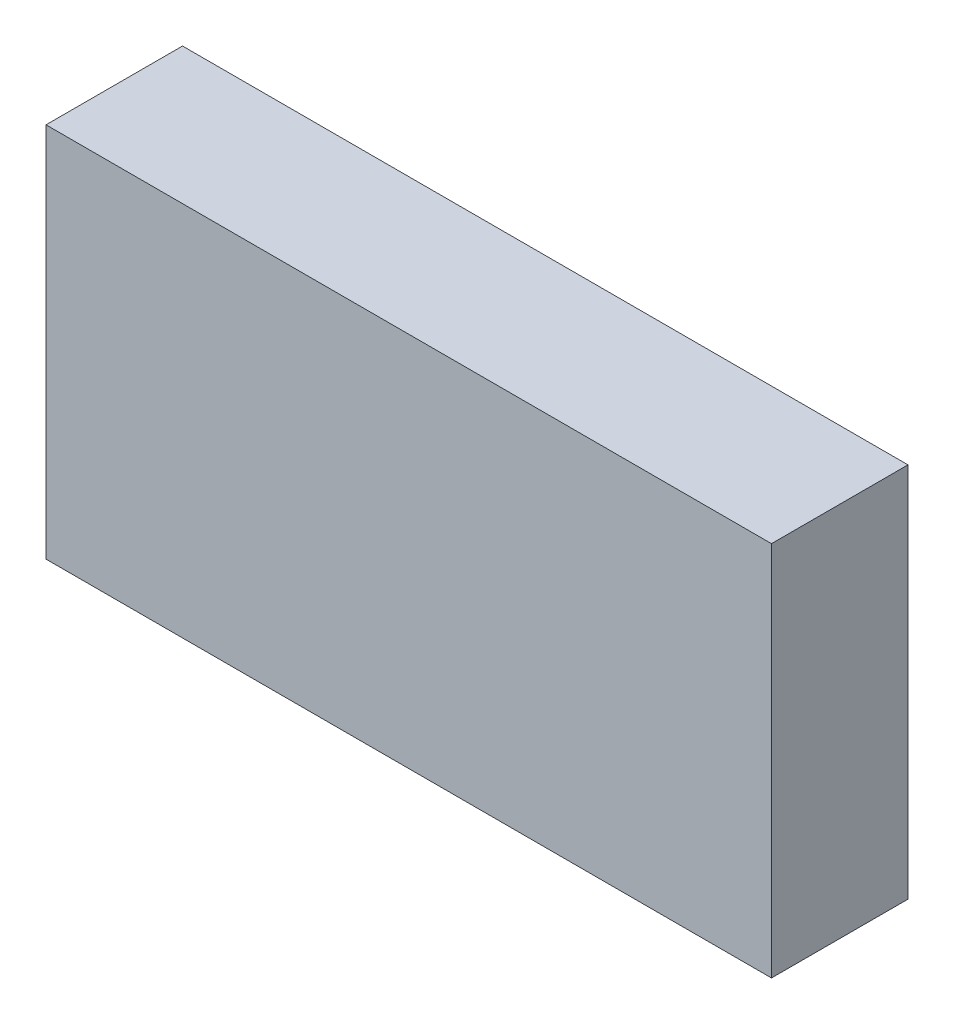
ISO-10303-21;
HEADER;
FILE_DESCRIPTION(('STEP AP214'),'2;1');
FILE_NAME('part.step','',(''),(''),'','','');
FILE_SCHEMA(('AUTOMOTIVE_DESIGN { 1 0 10303 214 1 1 1 1 }'));
ENDSEC;
DATA;
#1=APPLICATION_CONTEXT('core data for automotive mechanical design processes');
#2=APPLICATION_PROTOCOL_DEFINITION('international standard','automotive_design',2000,#1);
#3=PRODUCT_CONTEXT('',#1,'mechanical');
#4=PRODUCT('Part','Part','',(#3));
#5=PRODUCT_RELATED_PRODUCT_CATEGORY('part','',(#4));
#6=PRODUCT_DEFINITION_FORMATION('','',#4);
#7=PRODUCT_DEFINITION_CONTEXT('part definition',#1,'design');
#8=PRODUCT_DEFINITION('design','',#6,#7);
#9=PRODUCT_DEFINITION_SHAPE('','',#8);
#10=(LENGTH_UNIT() NAMED_UNIT(*) SI_UNIT(.MILLI.,.METRE.));
#11=(NAMED_UNIT(*) PLANE_ANGLE_UNIT() SI_UNIT($,.RADIAN.));
#12=(NAMED_UNIT(*) SI_UNIT($,.STERADIAN.) SOLID_ANGLE_UNIT());
#13=UNCERTAINTY_MEASURE_WITH_UNIT(LENGTH_MEASURE(1.E-05),#10,'distance_accuracy_value','');
#14=(GEOMETRIC_REPRESENTATION_CONTEXT(3) GLOBAL_UNCERTAINTY_ASSIGNED_CONTEXT((#13)) GLOBAL_UNIT_ASSIGNED_CONTEXT((#10,
#11,#12)) REPRESENTATION_CONTEXT('',''));
#15=CARTESIAN_POINT('',(0.,0.,0.));
#16=DIRECTION('',(0.,0.,1.));
#17=DIRECTION('',(1.,0.,0.));
#18=AXIS2_PLACEMENT_3D('',#15,#16,#17);
#19=CARTESIAN_POINT('',(-0.67499992,0.3499993,0.));
#20=DIRECTION('',(1.,0.,0.));
#21=DIRECTION('',(0.,-1.,0.));
#22=AXIS2_PLACEMENT_3D('',#19,#20,#21);
#23=PLANE('',#22);
#24=DIRECTION('',(0.,-1.,0.));
#25=VECTOR('',#24,1.);
#26=CARTESIAN_POINT('',(-0.67499992,0.3499993,0.));
#27=LINE('',#26,#25);
#28=CARTESIAN_POINT('',(-0.67499992,0.3499993,0.));
#29=VERTEX_POINT('',#28);
#30=CARTESIAN_POINT('',(-0.67499992,-0.3499993,0.));
#31=VERTEX_POINT('',#30);
#32=EDGE_CURVE('E11',#29,#31,#27,.T.);
#33=ORIENTED_EDGE('',*,*,#32,.T.);
#34=DIRECTION('',(0.,0.,1.));
#35=VECTOR('',#34,1.);
#36=CARTESIAN_POINT('',(-0.67499992,-0.3499993,0.));
#37=LINE('',#36,#35);
#38=CARTESIAN_POINT('',(-0.67499992,-0.3499993,0.254));
#39=VERTEX_POINT('',#38);
#40=EDGE_CURVE('E24',#31,#39,#37,.T.);
#41=ORIENTED_EDGE('',*,*,#40,.T.);
#42=DIRECTION('',(0.,-1.,0.));
#43=VECTOR('',#42,1.);
#44=CARTESIAN_POINT('',(-0.67499992,0.3499993,0.254));
#45=LINE('',#44,#43);
#46=CARTESIAN_POINT('',(-0.67499992,0.3499993,0.254));
#47=VERTEX_POINT('',#46);
#48=EDGE_CURVE('E87',#47,#39,#45,.T.);
#49=ORIENTED_EDGE('',*,*,#48,.F.);
#50=DIRECTION('',(0.,0.,1.));
#51=VECTOR('',#50,1.);
#52=CARTESIAN_POINT('',(-0.67499992,0.3499993,0.));
#53=LINE('',#52,#51);
#54=EDGE_CURVE('E36',#29,#47,#53,.T.);
#55=ORIENTED_EDGE('',*,*,#54,.F.);
#56=EDGE_LOOP('',(#33,#41,#49,#55));
#57=FACE_BOUND('',#56,.T.);
#58=ADVANCED_FACE('F17',(#57),#23,.F.);
#59=CARTESIAN_POINT('',(-0.67499992,-0.3499993,0.));
#60=DIRECTION('',(0.,1.,0.));
#61=DIRECTION('',(1.,0.,0.));
#62=AXIS2_PLACEMENT_3D('',#59,#60,#61);
#63=PLANE('',#62);
#64=DIRECTION('',(1.,0.,0.));
#65=VECTOR('',#64,1.);
#66=CARTESIAN_POINT('',(-0.67499992,-0.3499993,0.));
#67=LINE('',#66,#65);
#68=CARTESIAN_POINT('',(0.67499992,-0.3499993,0.));
#69=VERTEX_POINT('',#68);
#70=EDGE_CURVE('E84',#31,#69,#67,.T.);
#71=ORIENTED_EDGE('',*,*,#70,.T.);
#72=DIRECTION('',(0.,0.,1.));
#73=VECTOR('',#72,1.);
#74=CARTESIAN_POINT('',(0.67499992,-0.3499993,0.));
#75=LINE('',#74,#73);
#76=CARTESIAN_POINT('',(0.67499992,-0.3499993,0.254));
#77=VERTEX_POINT('',#76);
#78=EDGE_CURVE('E82',#69,#77,#75,.T.);
#79=ORIENTED_EDGE('',*,*,#78,.T.);
#80=DIRECTION('',(1.,0.,0.));
#81=VECTOR('',#80,1.);
#82=CARTESIAN_POINT('',(-0.67499992,-0.3499993,0.254));
#83=LINE('',#82,#81);
#84=EDGE_CURVE('E62',#39,#77,#83,.T.);
#85=ORIENTED_EDGE('',*,*,#84,.F.);
#86=ORIENTED_EDGE('',*,*,#40,.F.);
#87=EDGE_LOOP('',(#71,#79,#85,#86));
#88=FACE_BOUND('',#87,.T.);
#89=ADVANCED_FACE('F89',(#88),#63,.F.);
#90=CARTESIAN_POINT('',(0.67499992,-0.3499993,0.));
#91=DIRECTION('',(-1.,0.,0.));
#92=DIRECTION('',(0.,1.,0.));
#93=AXIS2_PLACEMENT_3D('',#90,#91,#92);
#94=PLANE('',#93);
#95=DIRECTION('',(0.,1.,0.));
#96=VECTOR('',#95,1.);
#97=CARTESIAN_POINT('',(0.67499992,-0.3499993,0.));
#98=LINE('',#97,#96);
#99=CARTESIAN_POINT('',(0.67499992,0.3499993,0.));
#100=VERTEX_POINT('',#99);
#101=EDGE_CURVE('E71',#69,#100,#98,.T.);
#102=ORIENTED_EDGE('',*,*,#101,.T.);
#103=DIRECTION('',(0.,0.,1.));
#104=VECTOR('',#103,1.);
#105=CARTESIAN_POINT('',(0.67499992,0.3499993,0.));
#106=LINE('',#105,#104);
#107=CARTESIAN_POINT('',(0.67499992,0.3499993,0.254));
#108=VERTEX_POINT('',#107);
#109=EDGE_CURVE('E65',#100,#108,#106,.T.);
#110=ORIENTED_EDGE('',*,*,#109,.T.);
#111=DIRECTION('',(0.,1.,0.));
#112=VECTOR('',#111,1.);
#113=CARTESIAN_POINT('',(0.67499992,-0.3499993,0.254));
#114=LINE('',#113,#112);
#115=EDGE_CURVE('E57',#77,#108,#114,.T.);
#116=ORIENTED_EDGE('',*,*,#115,.F.);
#117=ORIENTED_EDGE('',*,*,#78,.F.);
#118=EDGE_LOOP('',(#102,#110,#116,#117));
#119=FACE_BOUND('',#118,.T.);
#120=ADVANCED_FACE('F69',(#119),#94,.F.);
#121=CARTESIAN_POINT('',(0.67499992,0.3499993,0.));
#122=DIRECTION('',(0.,-1.,0.));
#123=DIRECTION('',(-1.,0.,0.));
#124=AXIS2_PLACEMENT_3D('',#121,#122,#123);
#125=PLANE('',#124);
#126=DIRECTION('',(-1.,0.,0.));
#127=VECTOR('',#126,1.);
#128=CARTESIAN_POINT('',(0.67499992,0.3499993,0.));
#129=LINE('',#128,#127);
#130=EDGE_CURVE('E66',#100,#29,#129,.T.);
#131=ORIENTED_EDGE('',*,*,#130,.T.);
#132=ORIENTED_EDGE('',*,*,#54,.T.);
#133=DIRECTION('',(-1.,0.,0.));
#134=VECTOR('',#133,1.);
#135=CARTESIAN_POINT('',(0.67499992,0.3499993,0.254));
#136=LINE('',#135,#134);
#137=EDGE_CURVE('E61',#108,#47,#136,.T.);
#138=ORIENTED_EDGE('',*,*,#137,.F.);
#139=ORIENTED_EDGE('',*,*,#109,.F.);
#140=EDGE_LOOP('',(#131,#132,#138,#139));
#141=FACE_BOUND('',#140,.T.);
#142=ADVANCED_FACE('F76',(#141),#125,.F.);
#143=CARTESIAN_POINT('',(-0.67499992,0.3499993,0.));
#144=DIRECTION('',(0.,0.,-1.));
#145=DIRECTION('',(-1.,0.,0.));
#146=AXIS2_PLACEMENT_3D('',#143,#144,#145);
#147=PLANE('',#146);
#148=ORIENTED_EDGE('',*,*,#130,.F.);
#149=ORIENTED_EDGE('',*,*,#101,.F.);
#150=ORIENTED_EDGE('',*,*,#70,.F.);
#151=ORIENTED_EDGE('',*,*,#32,.F.);
#152=EDGE_LOOP('',(#148,#149,#150,#151));
#153=FACE_BOUND('',#152,.T.);
#154=ADVANCED_FACE('F91',(#153),#147,.T.);
#155=CARTESIAN_POINT('',(-0.67499992,0.3499993,0.254));
#156=DIRECTION('',(0.,0.,-1.));
#157=DIRECTION('',(-1.,0.,0.));
#158=AXIS2_PLACEMENT_3D('',#155,#156,#157);
#159=PLANE('',#158);
#160=ORIENTED_EDGE('',*,*,#48,.T.);
#161=ORIENTED_EDGE('',*,*,#84,.T.);
#162=ORIENTED_EDGE('',*,*,#115,.T.);
#163=ORIENTED_EDGE('',*,*,#137,.T.);
#164=EDGE_LOOP('',(#160,#161,#162,#163));
#165=FACE_BOUND('',#164,.T.);
#166=ADVANCED_FACE('F59',(#165),#159,.F.);
#167=CLOSED_SHELL('',(#58,#89,#120,#142,#154,#166));
#168=MANIFOLD_SOLID_BREP('B1',#167);
#169=ADVANCED_BREP_SHAPE_REPRESENTATION('',(#18,#168),#14);
#170=SHAPE_DEFINITION_REPRESENTATION(#9,#169);
ENDSEC;
END-ISO-10303-21;
